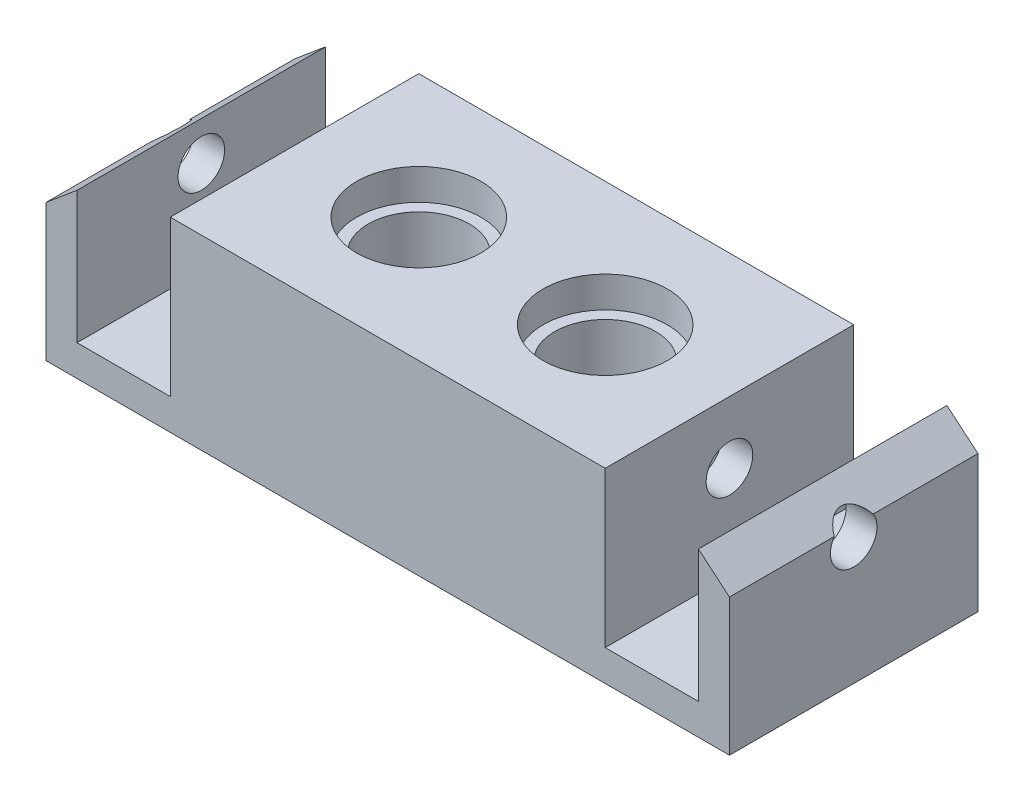
ISO-10303-21;
HEADER;
FILE_DESCRIPTION(('STEP AP214'),'2;1');
FILE_NAME('part.step','',(''),(''),'','','');
FILE_SCHEMA(('AUTOMOTIVE_DESIGN { 1 0 10303 214 1 1 1 1 }'));
ENDSEC;
DATA;
#1=APPLICATION_CONTEXT('core data for automotive mechanical design processes');
#2=APPLICATION_PROTOCOL_DEFINITION('international standard','automotive_design',2000,#1);
#3=PRODUCT_CONTEXT('',#1,'mechanical');
#4=PRODUCT('Part','Part','',(#3));
#5=PRODUCT_RELATED_PRODUCT_CATEGORY('part','',(#4));
#6=PRODUCT_DEFINITION_FORMATION('','',#4);
#7=PRODUCT_DEFINITION_CONTEXT('part definition',#1,'design');
#8=PRODUCT_DEFINITION('design','',#6,#7);
#9=PRODUCT_DEFINITION_SHAPE('','',#8);
#10=(LENGTH_UNIT() NAMED_UNIT(*) SI_UNIT(.MILLI.,.METRE.));
#11=(NAMED_UNIT(*) PLANE_ANGLE_UNIT() SI_UNIT($,.RADIAN.));
#12=(NAMED_UNIT(*) SI_UNIT($,.STERADIAN.) SOLID_ANGLE_UNIT());
#13=UNCERTAINTY_MEASURE_WITH_UNIT(LENGTH_MEASURE(1.E-05),#10,'distance_accuracy_value','');
#14=(GEOMETRIC_REPRESENTATION_CONTEXT(3) GLOBAL_UNCERTAINTY_ASSIGNED_CONTEXT((#13)) GLOBAL_UNIT_ASSIGNED_CONTEXT((#10,
#11,#12)) REPRESENTATION_CONTEXT('',''));
#15=CARTESIAN_POINT('',(0.,0.,0.));
#16=DIRECTION('',(0.,0.,1.));
#17=DIRECTION('',(1.,0.,0.));
#18=AXIS2_PLACEMENT_3D('',#15,#16,#17);
#19=CARTESIAN_POINT('',(14.,3.,-4.));
#20=DIRECTION('',(0.,-1.,0.));
#21=DIRECTION('',(0.,0.,-1.));
#22=AXIS2_PLACEMENT_3D('',#19,#20,#21);
#23=PLANE('',#22);
#24=CARTESIAN_POINT('',(14.,3.,-4.));
#25=DIRECTION('',(0.,-1.,0.));
#26=DIRECTION('',(0.,0.,-1.));
#27=AXIS2_PLACEMENT_3D('',#24,#25,#26);
#28=CIRCLE('',#27,2.5);
#29=CARTESIAN_POINT('',(14.,3.,-6.5));
#30=VERTEX_POINT('',#29);
#31=EDGE_CURVE('E11',#30,#30,#28,.T.);
#32=ORIENTED_EDGE('',*,*,#31,.T.);
#33=EDGE_LOOP('',(#32));
#34=FACE_BOUND('',#33,.T.);
#35=CARTESIAN_POINT('',(14.,3.,-4.));
#36=DIRECTION('',(0.,-1.,0.));
#37=DIRECTION('',(0.,0.,-1.));
#38=AXIS2_PLACEMENT_3D('',#35,#36,#37);
#39=CIRCLE('',#38,1.625);
#40=CARTESIAN_POINT('',(14.,3.,-5.625));
#41=VERTEX_POINT('',#40);
#42=EDGE_CURVE('E57',#41,#41,#39,.T.);
#43=ORIENTED_EDGE('',*,*,#42,.F.);
#44=EDGE_LOOP('',(#43));
#45=FACE_BOUND('',#44,.T.);
#46=ADVANCED_FACE('F46',(#34,#45),#23,.T.);
#47=CARTESIAN_POINT('',(14.,5.,-4.));
#48=DIRECTION('',(0.,-1.,0.));
#49=DIRECTION('',(0.,0.,-1.));
#50=AXIS2_PLACEMENT_3D('',#47,#48,#49);
#51=PLANE('',#50);
#52=CARTESIAN_POINT('',(14.,5.,-4.));
#53=DIRECTION('',(0.,-1.,0.));
#54=DIRECTION('',(0.,0.,-1.));
#55=AXIS2_PLACEMENT_3D('',#52,#53,#54);
#56=CIRCLE('',#55,2.5);
#57=CARTESIAN_POINT('',(14.,5.,-6.5));
#58=VERTEX_POINT('',#57);
#59=EDGE_CURVE('E50',#58,#58,#56,.T.);
#60=ORIENTED_EDGE('',*,*,#59,.F.);
#61=EDGE_LOOP('',(#60));
#62=FACE_BOUND('',#61,.T.);
#63=CARTESIAN_POINT('',(14.,5.,-4.));
#64=DIRECTION('',(0.,-1.,0.));
#65=DIRECTION('',(0.,0.,-1.));
#66=AXIS2_PLACEMENT_3D('',#63,#64,#65);
#67=CIRCLE('',#66,1.625);
#68=CARTESIAN_POINT('',(14.,5.,-5.625));
#69=VERTEX_POINT('',#68);
#70=EDGE_CURVE('E59',#69,#69,#67,.T.);
#71=ORIENTED_EDGE('',*,*,#70,.T.);
#72=EDGE_LOOP('',(#71));
#73=FACE_BOUND('',#72,.T.);
#74=ADVANCED_FACE('F69',(#62,#73),#51,.F.);
#75=CARTESIAN_POINT('',(14.,3.,-4.));
#76=DIRECTION('',(0.,1.,0.));
#77=DIRECTION('',(0.,0.,1.));
#78=AXIS2_PLACEMENT_3D('',#75,#76,#77);
#79=CYLINDRICAL_SURFACE('',#78,2.5);
#80=ORIENTED_EDGE('',*,*,#31,.F.);
#81=EDGE_LOOP('',(#80));
#82=FACE_BOUND('',#81,.T.);
#83=ORIENTED_EDGE('',*,*,#59,.T.);
#84=EDGE_LOOP('',(#83));
#85=FACE_BOUND('',#84,.T.);
#86=ADVANCED_FACE('F48',(#82,#85),#79,.T.);
#87=CARTESIAN_POINT('',(14.,3.,-4.));
#88=DIRECTION('',(0.,1.,0.));
#89=DIRECTION('',(0.,0.,1.));
#90=AXIS2_PLACEMENT_3D('',#87,#88,#89);
#91=CYLINDRICAL_SURFACE('',#90,1.625);
#92=ORIENTED_EDGE('',*,*,#42,.T.);
#93=EDGE_LOOP('',(#92));
#94=FACE_BOUND('',#93,.T.);
#95=ORIENTED_EDGE('',*,*,#70,.F.);
#96=EDGE_LOOP('',(#95));
#97=FACE_BOUND('',#96,.T.);
#98=ADVANCED_FACE('F65',(#94,#97),#91,.F.);
#99=CLOSED_SHELL('',(#46,#74,#86,#98));
#100=MANIFOLD_SOLID_BREP('B2',#99);
#101=CARTESIAN_POINT('',(8.,3.,-4.));
#102=DIRECTION('',(0.,-1.,0.));
#103=DIRECTION('',(0.,0.,-1.));
#104=AXIS2_PLACEMENT_3D('',#101,#102,#103);
#105=PLANE('',#104);
#106=CARTESIAN_POINT('',(8.,3.,-4.));
#107=DIRECTION('',(0.,-1.,0.));
#108=DIRECTION('',(0.,0.,-1.));
#109=AXIS2_PLACEMENT_3D('',#106,#107,#108);
#110=CIRCLE('',#109,2.5);
#111=CARTESIAN_POINT('',(8.,3.,-6.5));
#112=VERTEX_POINT('',#111);
#113=EDGE_CURVE('E45',#112,#112,#110,.T.);
#114=ORIENTED_EDGE('',*,*,#113,.T.);
#115=EDGE_LOOP('',(#114));
#116=FACE_BOUND('',#115,.T.);
#117=CARTESIAN_POINT('',(8.,3.,-4.));
#118=DIRECTION('',(0.,-1.,0.));
#119=DIRECTION('',(0.,0.,-1.));
#120=AXIS2_PLACEMENT_3D('',#117,#118,#119);
#121=CIRCLE('',#120,1.625);
#122=CARTESIAN_POINT('',(8.,3.,-5.625));
#123=VERTEX_POINT('',#122);
#124=EDGE_CURVE('E130',#123,#123,#121,.T.);
#125=ORIENTED_EDGE('',*,*,#124,.F.);
#126=EDGE_LOOP('',(#125));
#127=FACE_BOUND('',#126,.T.);
#128=ADVANCED_FACE('F119',(#116,#127),#105,.T.);
#129=CARTESIAN_POINT('',(8.,5.,-4.));
#130=DIRECTION('',(0.,-1.,0.));
#131=DIRECTION('',(0.,0.,-1.));
#132=AXIS2_PLACEMENT_3D('',#129,#130,#131);
#133=PLANE('',#132);
#134=CARTESIAN_POINT('',(8.,5.,-4.));
#135=DIRECTION('',(0.,-1.,0.));
#136=DIRECTION('',(0.,0.,-1.));
#137=AXIS2_PLACEMENT_3D('',#134,#135,#136);
#138=CIRCLE('',#137,2.5);
#139=CARTESIAN_POINT('',(8.,5.,-6.5));
#140=VERTEX_POINT('',#139);
#141=EDGE_CURVE('E123',#140,#140,#138,.T.);
#142=ORIENTED_EDGE('',*,*,#141,.F.);
#143=EDGE_LOOP('',(#142));
#144=FACE_BOUND('',#143,.T.);
#145=CARTESIAN_POINT('',(8.,5.,-4.));
#146=DIRECTION('',(0.,-1.,0.));
#147=DIRECTION('',(0.,0.,-1.));
#148=AXIS2_PLACEMENT_3D('',#145,#146,#147);
#149=CIRCLE('',#148,1.625);
#150=CARTESIAN_POINT('',(8.,5.,-5.625));
#151=VERTEX_POINT('',#150);
#152=EDGE_CURVE('E132',#151,#151,#149,.T.);
#153=ORIENTED_EDGE('',*,*,#152,.T.);
#154=EDGE_LOOP('',(#153));
#155=FACE_BOUND('',#154,.T.);
#156=ADVANCED_FACE('F142',(#144,#155),#133,.F.);
#157=CARTESIAN_POINT('',(8.,3.,-4.));
#158=DIRECTION('',(0.,1.,0.));
#159=DIRECTION('',(0.,0.,1.));
#160=AXIS2_PLACEMENT_3D('',#157,#158,#159);
#161=CYLINDRICAL_SURFACE('',#160,2.5);
#162=ORIENTED_EDGE('',*,*,#113,.F.);
#163=EDGE_LOOP('',(#162));
#164=FACE_BOUND('',#163,.T.);
#165=ORIENTED_EDGE('',*,*,#141,.T.);
#166=EDGE_LOOP('',(#165));
#167=FACE_BOUND('',#166,.T.);
#168=ADVANCED_FACE('F121',(#164,#167),#161,.T.);
#169=CARTESIAN_POINT('',(8.,3.,-4.));
#170=DIRECTION('',(0.,1.,0.));
#171=DIRECTION('',(0.,0.,1.));
#172=AXIS2_PLACEMENT_3D('',#169,#170,#171);
#173=CYLINDRICAL_SURFACE('',#172,1.625);
#174=ORIENTED_EDGE('',*,*,#124,.T.);
#175=EDGE_LOOP('',(#174));
#176=FACE_BOUND('',#175,.T.);
#177=ORIENTED_EDGE('',*,*,#152,.F.);
#178=EDGE_LOOP('',(#177));
#179=FACE_BOUND('',#178,.T.);
#180=ADVANCED_FACE('F138',(#176,#179),#173,.F.);
#181=CLOSED_SHELL('',(#128,#156,#168,#180));
#182=MANIFOLD_SOLID_BREP('B6',#181);
#183=CARTESIAN_POINT('',(0.,0.,-8.));
#184=DIRECTION('',(-1.,0.,0.));
#185=DIRECTION('',(0.,0.,1.));
#186=AXIS2_PLACEMENT_3D('',#183,#184,#185);
#187=PLANE('',#186);
#188=DIRECTION('',(0.,-1.,0.));
#189=VECTOR('',#188,1.);
#190=CARTESIAN_POINT('',(0.,0.,0.));
#191=LINE('',#190,#189);
#192=CARTESIAN_POINT('',(0.,4.41090036882271,0.));
#193=VERTEX_POINT('',#192);
#194=CARTESIAN_POINT('',(0.,0.,0.));
#195=VERTEX_POINT('',#194);
#196=EDGE_CURVE('E318',#193,#195,#191,.T.);
#197=ORIENTED_EDGE('',*,*,#196,.F.);
#198=DIRECTION('',(0.,0.,1.));
#199=VECTOR('',#198,1.);
#200=CARTESIAN_POINT('',(0.,4.41090036882271,-10.));
#201=LINE('',#200,#199);
#202=CARTESIAN_POINT('',(0.,4.41090036882271,-3.3725759911341));
#203=VERTEX_POINT('',#202);
#204=EDGE_CURVE('E304',#203,#193,#201,.T.);
#205=ORIENTED_EDGE('',*,*,#204,.F.);
#206=CARTESIAN_POINT('',(0.,4.,-4.));
#207=DIRECTION('',(1.,0.,0.));
#208=DIRECTION('',(0.,0.,-1.));
#209=AXIS2_PLACEMENT_3D('',#206,#207,#208);
#210=CIRCLE('',#209,0.750000000000001);
#211=CARTESIAN_POINT('',(0.,4.41090036882271,-4.6274240088659));
#212=VERTEX_POINT('',#211);
#213=EDGE_CURVE('E354',#203,#212,#210,.T.);
#214=ORIENTED_EDGE('',*,*,#213,.T.);
#215=CARTESIAN_POINT('',(0.,4.41090036882271,-8.));
#216=VERTEX_POINT('',#215);
#217=EDGE_CURVE('E197',#216,#212,#201,.T.);
#218=ORIENTED_EDGE('',*,*,#217,.F.);
#219=DIRECTION('',(0.,-1.,0.));
#220=VECTOR('',#219,1.);
#221=CARTESIAN_POINT('',(0.,0.,-8.));
#222=LINE('',#221,#220);
#223=CARTESIAN_POINT('',(0.,0.,-8.));
#224=VERTEX_POINT('',#223);
#225=EDGE_CURVE('E342',#216,#224,#222,.T.);
#226=ORIENTED_EDGE('',*,*,#225,.T.);
#227=DIRECTION('',(0.,0.,1.));
#228=VECTOR('',#227,1.);
#229=CARTESIAN_POINT('',(0.,0.,-8.));
#230=LINE('',#229,#228);
#231=EDGE_CURVE('E324',#224,#195,#230,.T.);
#232=ORIENTED_EDGE('',*,*,#231,.T.);
#233=EDGE_LOOP('',(#197,#205,#214,#218,#226,#232));
#234=FACE_BOUND('',#233,.T.);
#235=ADVANCED_FACE('F183',(#234),#187,.T.);
#236=CARTESIAN_POINT('',(0.,0.,-8.));
#237=DIRECTION('',(0.,0.,-1.));
#238=DIRECTION('',(-1.,0.,0.));
#239=AXIS2_PLACEMENT_3D('',#236,#237,#238);
#240=PLANE('',#239);
#241=ORIENTED_EDGE('',*,*,#225,.F.);
#242=DIRECTION('',(0.766044443118975,0.642787609686543,0.));
#243=VECTOR('',#242,1.);
#244=CARTESIAN_POINT('',(-2.17194444049051,2.58842258986957,-8.));
#245=LINE('',#244,#243);
#246=CARTESIAN_POINT('',(1.,5.25,-8.));
#247=VERTEX_POINT('',#246);
#248=EDGE_CURVE('E503',#216,#247,#245,.T.);
#249=ORIENTED_EDGE('',*,*,#248,.T.);
#250=DIRECTION('',(0.,-1.,0.));
#251=VECTOR('',#250,1.);
#252=CARTESIAN_POINT('',(1.,6.,-8.));
#253=LINE('',#252,#251);
#254=CARTESIAN_POINT('',(1.,1.,-8.));
#255=VERTEX_POINT('',#254);
#256=EDGE_CURVE('E378',#247,#255,#253,.T.);
#257=ORIENTED_EDGE('',*,*,#256,.T.);
#258=DIRECTION('',(1.,0.,0.));
#259=VECTOR('',#258,1.);
#260=CARTESIAN_POINT('',(1.,1.,-8.));
#261=LINE('',#260,#259);
#262=CARTESIAN_POINT('',(4.,1.,-8.));
#263=VERTEX_POINT('',#262);
#264=EDGE_CURVE('E380',#255,#263,#261,.T.);
#265=ORIENTED_EDGE('',*,*,#264,.T.);
#266=DIRECTION('',(0.,1.,0.));
#267=VECTOR('',#266,1.);
#268=CARTESIAN_POINT('',(4.,6.,-8.));
#269=LINE('',#268,#267);
#270=CARTESIAN_POINT('',(4.,6.,-8.));
#271=VERTEX_POINT('',#270);
#272=EDGE_CURVE('E384',#263,#271,#269,.T.);
#273=ORIENTED_EDGE('',*,*,#272,.T.);
#274=DIRECTION('',(-1.,0.,0.));
#275=VECTOR('',#274,1.);
#276=CARTESIAN_POINT('',(0.,6.,-8.));
#277=LINE('',#276,#275);
#278=CARTESIAN_POINT('',(18.,6.,-8.));
#279=VERTEX_POINT('',#278);
#280=EDGE_CURVE('E334',#279,#271,#277,.T.);
#281=ORIENTED_EDGE('',*,*,#280,.F.);
#282=DIRECTION('',(0.,-1.,0.));
#283=VECTOR('',#282,1.);
#284=CARTESIAN_POINT('',(18.,6.,-8.));
#285=LINE('',#284,#283);
#286=CARTESIAN_POINT('',(18.,1.,-8.));
#287=VERTEX_POINT('',#286);
#288=EDGE_CURVE('E402',#279,#287,#285,.T.);
#289=ORIENTED_EDGE('',*,*,#288,.T.);
#290=DIRECTION('',(1.,0.,0.));
#291=VECTOR('',#290,1.);
#292=CARTESIAN_POINT('',(21.,1.,-8.));
#293=LINE('',#292,#291);
#294=CARTESIAN_POINT('',(21.,1.,-8.));
#295=VERTEX_POINT('',#294);
#296=EDGE_CURVE('E405',#287,#295,#293,.T.);
#297=ORIENTED_EDGE('',*,*,#296,.T.);
#298=DIRECTION('',(0.,1.,0.));
#299=VECTOR('',#298,1.);
#300=CARTESIAN_POINT('',(21.,6.,-8.));
#301=LINE('',#300,#299);
#302=CARTESIAN_POINT('',(21.,5.25,-8.));
#303=VERTEX_POINT('',#302);
#304=EDGE_CURVE('E409',#295,#303,#301,.T.);
#305=ORIENTED_EDGE('',*,*,#304,.T.);
#306=DIRECTION('',(-0.766044443118975,0.642787609686543,0.));
#307=VECTOR('',#306,1.);
#308=CARTESIAN_POINT('',(11.2618144861544,13.4213078730039,-8.));
#309=LINE('',#308,#307);
#310=CARTESIAN_POINT('',(22.,4.41090036882271,-8.));
#311=VERTEX_POINT('',#310);
#312=EDGE_CURVE('E494',#311,#303,#309,.T.);
#313=ORIENTED_EDGE('',*,*,#312,.F.);
#314=DIRECTION('',(0.,1.,0.));
#315=VECTOR('',#314,1.);
#316=CARTESIAN_POINT('',(22.,0.,-8.));
#317=LINE('',#316,#315);
#318=CARTESIAN_POINT('',(22.,0.,-8.));
#319=VERTEX_POINT('',#318);
#320=EDGE_CURVE('E467',#319,#311,#317,.T.);
#321=ORIENTED_EDGE('',*,*,#320,.F.);
#322=DIRECTION('',(1.,0.,0.));
#323=VECTOR('',#322,1.);
#324=CARTESIAN_POINT('',(0.,0.,-8.));
#325=LINE('',#324,#323);
#326=EDGE_CURVE('E465',#224,#319,#325,.T.);
#327=ORIENTED_EDGE('',*,*,#326,.F.);
#328=EDGE_LOOP('',(#241,#249,#257,#265,#273,#281,#289,#297,#305,#313,#321,#327));
#329=FACE_BOUND('',#328,.T.);
#330=ADVANCED_FACE('F478',(#329),#240,.T.);
#331=CARTESIAN_POINT('',(0.,0.,0.));
#332=DIRECTION('',(0.,0.,-1.));
#333=DIRECTION('',(-1.,0.,0.));
#334=AXIS2_PLACEMENT_3D('',#331,#332,#333);
#335=PLANE('',#334);
#336=DIRECTION('',(-0.766044443118975,-0.642787609686543,0.));
#337=VECTOR('',#336,1.);
#338=CARTESIAN_POINT('',(0.,4.41090036882271,0.));
#339=LINE('',#338,#337);
#340=CARTESIAN_POINT('',(1.,5.25,0.));
#341=VERTEX_POINT('',#340);
#342=EDGE_CURVE('E307',#341,#193,#339,.T.);
#343=ORIENTED_EDGE('',*,*,#342,.T.);
#344=ORIENTED_EDGE('',*,*,#196,.T.);
#345=DIRECTION('',(1.,0.,0.));
#346=VECTOR('',#345,1.);
#347=CARTESIAN_POINT('',(0.,0.,0.));
#348=LINE('',#347,#346);
#349=CARTESIAN_POINT('',(22.,0.,0.));
#350=VERTEX_POINT('',#349);
#351=EDGE_CURVE('E326',#195,#350,#348,.T.);
#352=ORIENTED_EDGE('',*,*,#351,.T.);
#353=DIRECTION('',(0.,1.,0.));
#354=VECTOR('',#353,1.);
#355=CARTESIAN_POINT('',(22.,0.,0.));
#356=LINE('',#355,#354);
#357=CARTESIAN_POINT('',(22.,4.41090036882271,0.));
#358=VERTEX_POINT('',#357);
#359=EDGE_CURVE('E329',#350,#358,#356,.T.);
#360=ORIENTED_EDGE('',*,*,#359,.T.);
#361=DIRECTION('',(0.766044443118975,-0.642787609686543,0.));
#362=VECTOR('',#361,1.);
#363=CARTESIAN_POINT('',(22.,4.41090036882271,0.));
#364=LINE('',#363,#362);
#365=CARTESIAN_POINT('',(21.,5.25,0.));
#366=VERTEX_POINT('',#365);
#367=EDGE_CURVE('E500',#366,#358,#364,.T.);
#368=ORIENTED_EDGE('',*,*,#367,.F.);
#369=DIRECTION('',(0.,1.,0.));
#370=VECTOR('',#369,1.);
#371=CARTESIAN_POINT('',(21.,6.,0.));
#372=LINE('',#371,#370);
#373=CARTESIAN_POINT('',(21.,1.,0.));
#374=VERTEX_POINT('',#373);
#375=EDGE_CURVE('E406',#374,#366,#372,.T.);
#376=ORIENTED_EDGE('',*,*,#375,.F.);
#377=DIRECTION('',(1.,0.,0.));
#378=VECTOR('',#377,1.);
#379=CARTESIAN_POINT('',(21.,1.,0.));
#380=LINE('',#379,#378);
#381=CARTESIAN_POINT('',(18.,1.,0.));
#382=VERTEX_POINT('',#381);
#383=EDGE_CURVE('E415',#382,#374,#380,.T.);
#384=ORIENTED_EDGE('',*,*,#383,.F.);
#385=DIRECTION('',(0.,-1.,0.));
#386=VECTOR('',#385,1.);
#387=CARTESIAN_POINT('',(18.,6.,0.));
#388=LINE('',#387,#386);
#389=CARTESIAN_POINT('',(18.,6.,0.));
#390=VERTEX_POINT('',#389);
#391=EDGE_CURVE('E377',#390,#382,#388,.T.);
#392=ORIENTED_EDGE('',*,*,#391,.F.);
#393=DIRECTION('',(-1.,0.,0.));
#394=VECTOR('',#393,1.);
#395=CARTESIAN_POINT('',(0.,6.,0.));
#396=LINE('',#395,#394);
#397=CARTESIAN_POINT('',(4.,6.,0.));
#398=VERTEX_POINT('',#397);
#399=EDGE_CURVE('E339',#390,#398,#396,.T.);
#400=ORIENTED_EDGE('',*,*,#399,.T.);
#401=DIRECTION('',(0.,1.,0.));
#402=VECTOR('',#401,1.);
#403=CARTESIAN_POINT('',(4.,6.,0.));
#404=LINE('',#403,#402);
#405=CARTESIAN_POINT('',(4.,1.,0.));
#406=VERTEX_POINT('',#405);
#407=EDGE_CURVE('E381',#406,#398,#404,.T.);
#408=ORIENTED_EDGE('',*,*,#407,.F.);
#409=DIRECTION('',(1.,0.,0.));
#410=VECTOR('',#409,1.);
#411=CARTESIAN_POINT('',(1.,1.,0.));
#412=LINE('',#411,#410);
#413=CARTESIAN_POINT('',(1.,1.,0.));
#414=VERTEX_POINT('',#413);
#415=EDGE_CURVE('E389',#414,#406,#412,.T.);
#416=ORIENTED_EDGE('',*,*,#415,.F.);
#417=DIRECTION('',(0.,-1.,0.));
#418=VECTOR('',#417,1.);
#419=CARTESIAN_POINT('',(1.,6.,0.));
#420=LINE('',#419,#418);
#421=EDGE_CURVE('E321',#341,#414,#420,.T.);
#422=ORIENTED_EDGE('',*,*,#421,.F.);
#423=EDGE_LOOP('',(#343,#344,#352,#360,#368,#376,#384,#392,#400,#408,#416,#422));
#424=FACE_BOUND('',#423,.T.);
#425=ADVANCED_FACE('F316',(#424),#335,.F.);
#426=CARTESIAN_POINT('',(1.,6.,-8.));
#427=DIRECTION('',(-1.,0.,0.));
#428=DIRECTION('',(0.,-1.,0.));
#429=AXIS2_PLACEMENT_3D('',#426,#427,#428);
#430=PLANE('',#429);
#431=CARTESIAN_POINT('',(1.,4.,-4.));
#432=DIRECTION('',(-1.,0.,0.));
#433=DIRECTION('',(0.,-1.,0.));
#434=AXIS2_PLACEMENT_3D('',#431,#432,#433);
#435=CIRCLE('',#434,0.750000000000001);
#436=CARTESIAN_POINT('',(1.,3.25,-4.));
#437=VERTEX_POINT('',#436);
#438=EDGE_CURVE('E353',#437,#437,#435,.F.);
#439=ORIENTED_EDGE('',*,*,#438,.F.);
#440=EDGE_LOOP('',(#439));
#441=FACE_BOUND('',#440,.T.);
#442=DIRECTION('',(0.,0.,1.));
#443=VECTOR('',#442,1.);
#444=CARTESIAN_POINT('',(1.,5.25,-10.));
#445=LINE('',#444,#443);
#446=EDGE_CURVE('E518',#247,#341,#445,.T.);
#447=ORIENTED_EDGE('',*,*,#446,.T.);
#448=ORIENTED_EDGE('',*,*,#421,.T.);
#449=DIRECTION('',(0.,0.,1.));
#450=VECTOR('',#449,1.);
#451=CARTESIAN_POINT('',(1.,1.,-8.));
#452=LINE('',#451,#450);
#453=EDGE_CURVE('E387',#255,#414,#452,.T.);
#454=ORIENTED_EDGE('',*,*,#453,.F.);
#455=ORIENTED_EDGE('',*,*,#256,.F.);
#456=EDGE_LOOP('',(#447,#448,#454,#455));
#457=FACE_BOUND('',#456,.T.);
#458=ADVANCED_FACE('F513',(#441,#457),#430,.F.);
#459=CARTESIAN_POINT('',(5.5,4.,-4.));
#460=DIRECTION('',(-1.,0.,0.));
#461=DIRECTION('',(0.,0.,1.));
#462=AXIS2_PLACEMENT_3D('',#459,#460,#461);
#463=CYLINDRICAL_SURFACE('',#462,0.750000000000001);
#464=ORIENTED_EDGE('',*,*,#438,.T.);
#465=EDGE_LOOP('',(#464));
#466=FACE_BOUND('',#465,.T.);
#467=ORIENTED_EDGE('',*,*,#213,.F.);
#468=CARTESIAN_POINT('',(-0.489691990742751,4.,-4.));
#469=DIRECTION('',(-0.642787609686543,0.766044443118975,0.));
#470=DIRECTION('',(-0.766044443118975,-0.642787609686543,0.));
#471=AXIS2_PLACEMENT_3D('',#468,#469,#470);
#472=ELLIPSE('',#471,1.1667928701453,0.750000000000001);
#473=EDGE_CURVE('E117',#203,#212,#472,.T.);
#474=ORIENTED_EDGE('',*,*,#473,.T.);
#475=EDGE_LOOP('',(#467,#474));
#476=FACE_BOUND('',#475,.T.);
#477=ADVANCED_FACE('F510',(#466,#476),#463,.F.);
#478=CARTESIAN_POINT('',(0.,6.,-8.));
#479=DIRECTION('',(0.,1.,0.));
#480=DIRECTION('',(0.,0.,1.));
#481=AXIS2_PLACEMENT_3D('',#478,#479,#480);
#482=PLANE('',#481);
#483=DIRECTION('',(0.,0.,1.));
#484=VECTOR('',#483,1.);
#485=CARTESIAN_POINT('',(4.,6.,-8.));
#486=LINE('',#485,#484);
#487=EDGE_CURVE('E394',#271,#398,#486,.T.);
#488=ORIENTED_EDGE('',*,*,#487,.T.);
#489=ORIENTED_EDGE('',*,*,#399,.F.);
#490=DIRECTION('',(0.,0.,1.));
#491=VECTOR('',#490,1.);
#492=CARTESIAN_POINT('',(18.,6.,-8.));
#493=LINE('',#492,#491);
#494=EDGE_CURVE('E412',#279,#390,#493,.T.);
#495=ORIENTED_EDGE('',*,*,#494,.F.);
#496=ORIENTED_EDGE('',*,*,#280,.T.);
#497=EDGE_LOOP('',(#488,#489,#495,#496));
#498=FACE_BOUND('',#497,.T.);
#499=CARTESIAN_POINT('',(8.,6.,-4.));
#500=DIRECTION('',(0.,1.,0.));
#501=DIRECTION('',(0.,0.,1.));
#502=AXIS2_PLACEMENT_3D('',#499,#500,#501);
#503=CIRCLE('',#502,2.);
#504=CARTESIAN_POINT('',(8.,6.,-2.));
#505=VERTEX_POINT('',#504);
#506=EDGE_CURVE('E428',#505,#505,#503,.T.);
#507=ORIENTED_EDGE('',*,*,#506,.F.);
#508=EDGE_LOOP('',(#507));
#509=FACE_BOUND('',#508,.T.);
#510=CARTESIAN_POINT('',(14.,6.,-4.));
#511=DIRECTION('',(0.,1.,0.));
#512=DIRECTION('',(0.,0.,1.));
#513=AXIS2_PLACEMENT_3D('',#510,#511,#512);
#514=CIRCLE('',#513,2.);
#515=CARTESIAN_POINT('',(14.,6.,-2.));
#516=VERTEX_POINT('',#515);
#517=EDGE_CURVE('E397',#516,#516,#514,.T.);
#518=ORIENTED_EDGE('',*,*,#517,.F.);
#519=EDGE_LOOP('',(#518));
#520=FACE_BOUND('',#519,.T.);
#521=ADVANCED_FACE('F473',(#498,#509,#520),#482,.T.);
#522=CARTESIAN_POINT('',(22.,0.,-8.));
#523=DIRECTION('',(1.,0.,0.));
#524=DIRECTION('',(0.,0.,-1.));
#525=AXIS2_PLACEMENT_3D('',#522,#523,#524);
#526=PLANE('',#525);
#527=DIRECTION('',(0.,0.,1.));
#528=VECTOR('',#527,1.);
#529=CARTESIAN_POINT('',(22.,4.41090036882271,-10.));
#530=LINE('',#529,#528);
#531=CARTESIAN_POINT('',(22.,4.41090036882272,-3.3725759911341));
#532=VERTEX_POINT('',#531);
#533=EDGE_CURVE('E204',#532,#358,#530,.T.);
#534=ORIENTED_EDGE('',*,*,#533,.T.);
#535=ORIENTED_EDGE('',*,*,#359,.F.);
#536=DIRECTION('',(0.,0.,1.));
#537=VECTOR('',#536,1.);
#538=CARTESIAN_POINT('',(22.,0.,-8.));
#539=LINE('',#538,#537);
#540=EDGE_CURVE('E343',#319,#350,#539,.T.);
#541=ORIENTED_EDGE('',*,*,#540,.F.);
#542=ORIENTED_EDGE('',*,*,#320,.T.);
#543=CARTESIAN_POINT('',(22.,4.41090036882271,-4.6274240088659));
#544=VERTEX_POINT('',#543);
#545=EDGE_CURVE('E365',#311,#544,#530,.T.);
#546=ORIENTED_EDGE('',*,*,#545,.T.);
#547=CARTESIAN_POINT('',(22.,4.,-4.));
#548=DIRECTION('',(1.,0.,0.));
#549=DIRECTION('',(0.,0.,-1.));
#550=AXIS2_PLACEMENT_3D('',#547,#548,#549);
#551=CIRCLE('',#550,0.750000000000001);
#552=EDGE_CURVE('E350',#532,#544,#551,.T.);
#553=ORIENTED_EDGE('',*,*,#552,.F.);
#554=EDGE_LOOP('',(#534,#535,#541,#542,#546,#553));
#555=FACE_BOUND('',#554,.T.);
#556=ADVANCED_FACE('F362',(#555),#526,.T.);
#557=CARTESIAN_POINT('',(0.,0.,-8.));
#558=DIRECTION('',(0.,-1.,0.));
#559=DIRECTION('',(0.,0.,-1.));
#560=AXIS2_PLACEMENT_3D('',#557,#558,#559);
#561=PLANE('',#560);
#562=DIRECTION('',(0.,0.,1.));
#563=VECTOR('',#562,1.);
#564=CARTESIAN_POINT('',(17.,0.,-7.));
#565=LINE('',#564,#563);
#566=CARTESIAN_POINT('',(17.,0.,-7.));
#567=VERTEX_POINT('',#566);
#568=CARTESIAN_POINT('',(17.,0.,-1.));
#569=VERTEX_POINT('',#568);
#570=EDGE_CURVE('E427',#567,#569,#565,.T.);
#571=ORIENTED_EDGE('',*,*,#570,.F.);
#572=DIRECTION('',(1.,0.,0.));
#573=VECTOR('',#572,1.);
#574=CARTESIAN_POINT('',(5.,0.,-7.));
#575=LINE('',#574,#573);
#576=CARTESIAN_POINT('',(5.,0.,-7.));
#577=VERTEX_POINT('',#576);
#578=EDGE_CURVE('E440',#577,#567,#575,.T.);
#579=ORIENTED_EDGE('',*,*,#578,.F.);
#580=DIRECTION('',(0.,0.,-1.));
#581=VECTOR('',#580,1.);
#582=CARTESIAN_POINT('',(5.,0.,-7.));
#583=LINE('',#582,#581);
#584=CARTESIAN_POINT('',(5.,0.,-1.));
#585=VERTEX_POINT('',#584);
#586=EDGE_CURVE('E454',#585,#577,#583,.T.);
#587=ORIENTED_EDGE('',*,*,#586,.F.);
#588=DIRECTION('',(-1.,0.,0.));
#589=VECTOR('',#588,1.);
#590=CARTESIAN_POINT('',(5.,0.,-1.));
#591=LINE('',#590,#589);
#592=EDGE_CURVE('E451',#569,#585,#591,.T.);
#593=ORIENTED_EDGE('',*,*,#592,.F.);
#594=EDGE_LOOP('',(#571,#579,#587,#593));
#595=FACE_BOUND('',#594,.T.);
#596=ORIENTED_EDGE('',*,*,#351,.F.);
#597=ORIENTED_EDGE('',*,*,#231,.F.);
#598=ORIENTED_EDGE('',*,*,#326,.T.);
#599=ORIENTED_EDGE('',*,*,#540,.T.);
#600=EDGE_LOOP('',(#596,#597,#598,#599));
#601=FACE_BOUND('',#600,.T.);
#602=ADVANCED_FACE('F550',(#595,#601),#561,.T.);
#603=CARTESIAN_POINT('',(17.,5.,-7.));
#604=DIRECTION('',(1.,0.,0.));
#605=DIRECTION('',(0.,0.,-1.));
#606=AXIS2_PLACEMENT_3D('',#603,#604,#605);
#607=PLANE('',#606);
#608=CARTESIAN_POINT('',(17.,4.,-4.));
#609=DIRECTION('',(1.,0.,0.));
#610=DIRECTION('',(0.,0.,-1.));
#611=AXIS2_PLACEMENT_3D('',#608,#609,#610);
#612=CIRCLE('',#611,0.750000000000001);
#613=CARTESIAN_POINT('',(17.,4.,-4.75));
#614=VERTEX_POINT('',#613);
#615=EDGE_CURVE('E374',#614,#614,#612,.T.);
#616=ORIENTED_EDGE('',*,*,#615,.T.);
#617=EDGE_LOOP('',(#616));
#618=FACE_BOUND('',#617,.T.);
#619=ORIENTED_EDGE('',*,*,#570,.T.);
#620=DIRECTION('',(0.,-1.,0.));
#621=VECTOR('',#620,1.);
#622=CARTESIAN_POINT('',(17.,5.,-1.));
#623=LINE('',#622,#621);
#624=CARTESIAN_POINT('',(17.,5.,-1.));
#625=VERTEX_POINT('',#624);
#626=EDGE_CURVE('E449',#625,#569,#623,.T.);
#627=ORIENTED_EDGE('',*,*,#626,.F.);
#628=DIRECTION('',(0.,0.,1.));
#629=VECTOR('',#628,1.);
#630=CARTESIAN_POINT('',(17.,5.,-7.));
#631=LINE('',#630,#629);
#632=CARTESIAN_POINT('',(17.,5.,-7.));
#633=VERTEX_POINT('',#632);
#634=EDGE_CURVE('E436',#633,#625,#631,.T.);
#635=ORIENTED_EDGE('',*,*,#634,.F.);
#636=DIRECTION('',(0.,-1.,0.));
#637=VECTOR('',#636,1.);
#638=CARTESIAN_POINT('',(17.,5.,-7.));
#639=LINE('',#638,#637);
#640=EDGE_CURVE('E327',#633,#567,#639,.T.);
#641=ORIENTED_EDGE('',*,*,#640,.T.);
#642=EDGE_LOOP('',(#619,#627,#635,#641));
#643=FACE_BOUND('',#642,.T.);
#644=ADVANCED_FACE('F546',(#618,#643),#607,.F.);
#645=CARTESIAN_POINT('',(5.,5.,-7.));
#646=DIRECTION('',(0.,0.,-1.));
#647=DIRECTION('',(-1.,0.,0.));
#648=AXIS2_PLACEMENT_3D('',#645,#646,#647);
#649=PLANE('',#648);
#650=ORIENTED_EDGE('',*,*,#578,.T.);
#651=ORIENTED_EDGE('',*,*,#640,.F.);
#652=DIRECTION('',(1.,0.,0.));
#653=VECTOR('',#652,1.);
#654=CARTESIAN_POINT('',(5.,5.,-7.));
#655=LINE('',#654,#653);
#656=CARTESIAN_POINT('',(5.,5.,-7.));
#657=VERTEX_POINT('',#656);
#658=EDGE_CURVE('E446',#657,#633,#655,.T.);
#659=ORIENTED_EDGE('',*,*,#658,.F.);
#660=DIRECTION('',(0.,-1.,0.));
#661=VECTOR('',#660,1.);
#662=CARTESIAN_POINT('',(5.,5.,-7.));
#663=LINE('',#662,#661);
#664=EDGE_CURVE('E331',#657,#577,#663,.T.);
#665=ORIENTED_EDGE('',*,*,#664,.T.);
#666=EDGE_LOOP('',(#650,#651,#659,#665));
#667=FACE_BOUND('',#666,.T.);
#668=ADVANCED_FACE('F556',(#667),#649,.F.);
#669=CARTESIAN_POINT('',(5.,5.,-7.));
#670=DIRECTION('',(-1.,0.,0.));
#671=DIRECTION('',(0.,0.,1.));
#672=AXIS2_PLACEMENT_3D('',#669,#670,#671);
#673=PLANE('',#672);
#674=CARTESIAN_POINT('',(5.,4.,-4.));
#675=DIRECTION('',(-1.,0.,0.));
#676=DIRECTION('',(0.,0.,1.));
#677=AXIS2_PLACEMENT_3D('',#674,#675,#676);
#678=CIRCLE('',#677,0.750000000000001);
#679=CARTESIAN_POINT('',(5.,4.,-3.25));
#680=VERTEX_POINT('',#679);
#681=EDGE_CURVE('E366',#680,#680,#678,.F.);
#682=ORIENTED_EDGE('',*,*,#681,.F.);
#683=EDGE_LOOP('',(#682));
#684=FACE_BOUND('',#683,.T.);
#685=ORIENTED_EDGE('',*,*,#586,.T.);
#686=ORIENTED_EDGE('',*,*,#664,.F.);
#687=DIRECTION('',(0.,0.,-1.));
#688=VECTOR('',#687,1.);
#689=CARTESIAN_POINT('',(5.,5.,-7.));
#690=LINE('',#689,#688);
#691=CARTESIAN_POINT('',(5.,5.,-1.));
#692=VERTEX_POINT('',#691);
#693=EDGE_CURVE('E443',#692,#657,#690,.T.);
#694=ORIENTED_EDGE('',*,*,#693,.F.);
#695=DIRECTION('',(0.,-1.,0.));
#696=VECTOR('',#695,1.);
#697=CARTESIAN_POINT('',(5.,5.,-1.));
#698=LINE('',#697,#696);
#699=EDGE_CURVE('E460',#692,#585,#698,.T.);
#700=ORIENTED_EDGE('',*,*,#699,.T.);
#701=EDGE_LOOP('',(#685,#686,#694,#700));
#702=FACE_BOUND('',#701,.T.);
#703=ADVANCED_FACE('F654',(#684,#702),#673,.F.);
#704=CARTESIAN_POINT('',(5.,5.,-1.));
#705=DIRECTION('',(0.,0.,1.));
#706=DIRECTION('',(1.,0.,0.));
#707=AXIS2_PLACEMENT_3D('',#704,#705,#706);
#708=PLANE('',#707);
#709=ORIENTED_EDGE('',*,*,#592,.T.);
#710=ORIENTED_EDGE('',*,*,#699,.F.);
#711=DIRECTION('',(-1.,0.,0.));
#712=VECTOR('',#711,1.);
#713=CARTESIAN_POINT('',(5.,5.,-1.));
#714=LINE('',#713,#712);
#715=EDGE_CURVE('E439',#625,#692,#714,.T.);
#716=ORIENTED_EDGE('',*,*,#715,.F.);
#717=ORIENTED_EDGE('',*,*,#626,.T.);
#718=EDGE_LOOP('',(#709,#710,#716,#717));
#719=FACE_BOUND('',#718,.T.);
#720=ADVANCED_FACE('F659',(#719),#708,.F.);
#721=CARTESIAN_POINT('',(0.,5.,0.));
#722=DIRECTION('',(0.,1.,0.));
#723=DIRECTION('',(0.,0.,1.));
#724=AXIS2_PLACEMENT_3D('',#721,#722,#723);
#725=PLANE('',#724);
#726=CARTESIAN_POINT('',(8.,5.,-4.));
#727=DIRECTION('',(0.,1.,0.));
#728=DIRECTION('',(0.,0.,1.));
#729=AXIS2_PLACEMENT_3D('',#726,#727,#728);
#730=CIRCLE('',#729,2.);
#731=CARTESIAN_POINT('',(8.,5.,-2.));
#732=VERTEX_POINT('',#731);
#733=EDGE_CURVE('E424',#732,#732,#730,.T.);
#734=ORIENTED_EDGE('',*,*,#733,.T.);
#735=EDGE_LOOP('',(#734));
#736=FACE_BOUND('',#735,.T.);
#737=CARTESIAN_POINT('',(14.,5.,-4.));
#738=DIRECTION('',(0.,1.,0.));
#739=DIRECTION('',(0.,0.,1.));
#740=AXIS2_PLACEMENT_3D('',#737,#738,#739);
#741=CIRCLE('',#740,2.);
#742=CARTESIAN_POINT('',(14.,5.,-2.));
#743=VERTEX_POINT('',#742);
#744=EDGE_CURVE('E431',#743,#743,#741,.T.);
#745=ORIENTED_EDGE('',*,*,#744,.T.);
#746=EDGE_LOOP('',(#745));
#747=FACE_BOUND('',#746,.T.);
#748=ORIENTED_EDGE('',*,*,#634,.T.);
#749=ORIENTED_EDGE('',*,*,#715,.T.);
#750=ORIENTED_EDGE('',*,*,#693,.T.);
#751=ORIENTED_EDGE('',*,*,#658,.T.);
#752=EDGE_LOOP('',(#748,#749,#750,#751));
#753=FACE_BOUND('',#752,.T.);
#754=ADVANCED_FACE('F718',(#736,#747,#753),#725,.F.);
#755=CARTESIAN_POINT('',(14.,5.,-4.));
#756=DIRECTION('',(0.,1.,0.));
#757=DIRECTION('',(0.,0.,1.));
#758=AXIS2_PLACEMENT_3D('',#755,#756,#757);
#759=CYLINDRICAL_SURFACE('',#758,2.);
#760=ORIENTED_EDGE('',*,*,#744,.F.);
#761=EDGE_LOOP('',(#760));
#762=FACE_BOUND('',#761,.T.);
#763=ORIENTED_EDGE('',*,*,#517,.T.);
#764=EDGE_LOOP('',(#763));
#765=FACE_BOUND('',#764,.T.);
#766=ADVANCED_FACE('F708',(#762,#765),#759,.F.);
#767=CARTESIAN_POINT('',(8.,5.,-4.));
#768=DIRECTION('',(0.,1.,0.));
#769=DIRECTION('',(0.,0.,1.));
#770=AXIS2_PLACEMENT_3D('',#767,#768,#769);
#771=CYLINDRICAL_SURFACE('',#770,2.);
#772=ORIENTED_EDGE('',*,*,#733,.F.);
#773=EDGE_LOOP('',(#772));
#774=FACE_BOUND('',#773,.T.);
#775=ORIENTED_EDGE('',*,*,#506,.T.);
#776=EDGE_LOOP('',(#775));
#777=FACE_BOUND('',#776,.T.);
#778=ADVANCED_FACE('F617',(#774,#777),#771,.F.);
#779=CARTESIAN_POINT('',(21.,6.,-8.));
#780=DIRECTION('',(1.,0.,0.));
#781=DIRECTION('',(0.,0.,-1.));
#782=AXIS2_PLACEMENT_3D('',#779,#780,#781);
#783=PLANE('',#782);
#784=CARTESIAN_POINT('',(21.,4.,-4.));
#785=DIRECTION('',(1.,0.,0.));
#786=DIRECTION('',(0.,0.,-1.));
#787=AXIS2_PLACEMENT_3D('',#784,#785,#786);
#788=CIRCLE('',#787,0.750000000000001);
#789=CARTESIAN_POINT('',(21.,4.,-4.75));
#790=VERTEX_POINT('',#789);
#791=EDGE_CURVE('E349',#790,#790,#788,.T.);
#792=ORIENTED_EDGE('',*,*,#791,.T.);
#793=EDGE_LOOP('',(#792));
#794=FACE_BOUND('',#793,.T.);
#795=ORIENTED_EDGE('',*,*,#375,.T.);
#796=DIRECTION('',(0.,0.,1.));
#797=VECTOR('',#796,1.);
#798=CARTESIAN_POINT('',(21.,5.25,-10.));
#799=LINE('',#798,#797);
#800=EDGE_CURVE('E498',#303,#366,#799,.T.);
#801=ORIENTED_EDGE('',*,*,#800,.F.);
#802=ORIENTED_EDGE('',*,*,#304,.F.);
#803=DIRECTION('',(0.,0.,1.));
#804=VECTOR('',#803,1.);
#805=CARTESIAN_POINT('',(21.,1.,-8.));
#806=LINE('',#805,#804);
#807=EDGE_CURVE('E390',#295,#374,#806,.T.);
#808=ORIENTED_EDGE('',*,*,#807,.T.);
#809=EDGE_LOOP('',(#795,#801,#802,#808));
#810=FACE_BOUND('',#809,.T.);
#811=ADVANCED_FACE('F497',(#794,#810),#783,.F.);
#812=CARTESIAN_POINT('',(21.,1.,-8.));
#813=DIRECTION('',(0.,-1.,0.));
#814=DIRECTION('',(1.,0.,0.));
#815=AXIS2_PLACEMENT_3D('',#812,#813,#814);
#816=PLANE('',#815);
#817=ORIENTED_EDGE('',*,*,#383,.T.);
#818=ORIENTED_EDGE('',*,*,#807,.F.);
#819=ORIENTED_EDGE('',*,*,#296,.F.);
#820=DIRECTION('',(0.,0.,1.));
#821=VECTOR('',#820,1.);
#822=CARTESIAN_POINT('',(18.,1.,-8.));
#823=LINE('',#822,#821);
#824=EDGE_CURVE('E421',#287,#382,#823,.T.);
#825=ORIENTED_EDGE('',*,*,#824,.T.);
#826=EDGE_LOOP('',(#817,#818,#819,#825));
#827=FACE_BOUND('',#826,.T.);
#828=ADVANCED_FACE('F491',(#827),#816,.F.);
#829=CARTESIAN_POINT('',(18.,6.,-8.));
#830=DIRECTION('',(-1.,0.,0.));
#831=DIRECTION('',(0.,-1.,0.));
#832=AXIS2_PLACEMENT_3D('',#829,#830,#831);
#833=PLANE('',#832);
#834=CARTESIAN_POINT('',(18.,4.,-4.));
#835=DIRECTION('',(-1.,0.,0.));
#836=DIRECTION('',(0.,-1.,0.));
#837=AXIS2_PLACEMENT_3D('',#834,#835,#836);
#838=CIRCLE('',#837,0.750000000000001);
#839=CARTESIAN_POINT('',(18.,3.25,-4.));
#840=VERTEX_POINT('',#839);
#841=EDGE_CURVE('E346',#840,#840,#838,.T.);
#842=ORIENTED_EDGE('',*,*,#841,.T.);
#843=EDGE_LOOP('',(#842));
#844=FACE_BOUND('',#843,.T.);
#845=ORIENTED_EDGE('',*,*,#391,.T.);
#846=ORIENTED_EDGE('',*,*,#824,.F.);
#847=ORIENTED_EDGE('',*,*,#288,.F.);
#848=ORIENTED_EDGE('',*,*,#494,.T.);
#849=EDGE_LOOP('',(#845,#846,#847,#848));
#850=FACE_BOUND('',#849,.T.);
#851=ADVANCED_FACE('F488',(#844,#850),#833,.F.);
#852=CARTESIAN_POINT('',(4.,6.,-8.));
#853=DIRECTION('',(1.,0.,0.));
#854=DIRECTION('',(0.,1.,0.));
#855=AXIS2_PLACEMENT_3D('',#852,#853,#854);
#856=PLANE('',#855);
#857=CARTESIAN_POINT('',(4.,4.,-4.));
#858=DIRECTION('',(1.,0.,0.));
#859=DIRECTION('',(0.,1.,0.));
#860=AXIS2_PLACEMENT_3D('',#857,#858,#859);
#861=CIRCLE('',#860,0.750000000000001);
#862=CARTESIAN_POINT('',(4.,4.75,-4.));
#863=VERTEX_POINT('',#862);
#864=EDGE_CURVE('E351',#863,#863,#861,.F.);
#865=ORIENTED_EDGE('',*,*,#864,.F.);
#866=EDGE_LOOP('',(#865));
#867=FACE_BOUND('',#866,.T.);
#868=ORIENTED_EDGE('',*,*,#407,.T.);
#869=ORIENTED_EDGE('',*,*,#487,.F.);
#870=ORIENTED_EDGE('',*,*,#272,.F.);
#871=DIRECTION('',(0.,0.,1.));
#872=VECTOR('',#871,1.);
#873=CARTESIAN_POINT('',(4.,1.,-8.));
#874=LINE('',#873,#872);
#875=EDGE_CURVE('E398',#263,#406,#874,.T.);
#876=ORIENTED_EDGE('',*,*,#875,.T.);
#877=EDGE_LOOP('',(#868,#869,#870,#876));
#878=FACE_BOUND('',#877,.T.);
#879=ADVANCED_FACE('F482',(#867,#878),#856,.F.);
#880=CARTESIAN_POINT('',(1.,1.,-8.));
#881=DIRECTION('',(0.,-1.,0.));
#882=DIRECTION('',(0.,0.,-1.));
#883=AXIS2_PLACEMENT_3D('',#880,#881,#882);
#884=PLANE('',#883);
#885=ORIENTED_EDGE('',*,*,#415,.T.);
#886=ORIENTED_EDGE('',*,*,#875,.F.);
#887=ORIENTED_EDGE('',*,*,#264,.F.);
#888=ORIENTED_EDGE('',*,*,#453,.T.);
#889=EDGE_LOOP('',(#885,#886,#887,#888));
#890=FACE_BOUND('',#889,.T.);
#891=ADVANCED_FACE('F644',(#890),#884,.F.);
#892=CARTESIAN_POINT('',(16.5,4.,-4.));
#893=DIRECTION('',(1.,0.,0.));
#894=DIRECTION('',(0.,0.,-1.));
#895=AXIS2_PLACEMENT_3D('',#892,#893,#894);
#896=CYLINDRICAL_SURFACE('',#895,0.750000000000001);
#897=ORIENTED_EDGE('',*,*,#841,.F.);
#898=EDGE_LOOP('',(#897));
#899=FACE_BOUND('',#898,.T.);
#900=ORIENTED_EDGE('',*,*,#615,.F.);
#901=EDGE_LOOP('',(#900));
#902=FACE_BOUND('',#901,.T.);
#903=ADVANCED_FACE('F607',(#899,#902),#896,.F.);
#904=ORIENTED_EDGE('',*,*,#552,.T.);
#905=CARTESIAN_POINT('',(22.4896919907428,4.,-4.));
#906=DIRECTION('',(-0.642787609686543,-0.766044443118975,0.));
#907=DIRECTION('',(0.766044443118975,-0.642787609686543,0.));
#908=AXIS2_PLACEMENT_3D('',#905,#906,#907);
#909=ELLIPSE('',#908,1.1667928701453,0.750000000000001);
#910=EDGE_CURVE('E190',#544,#532,#909,.F.);
#911=ORIENTED_EDGE('',*,*,#910,.T.);
#912=EDGE_LOOP('',(#904,#911));
#913=FACE_BOUND('',#912,.T.);
#914=ORIENTED_EDGE('',*,*,#791,.F.);
#915=EDGE_LOOP('',(#914));
#916=FACE_BOUND('',#915,.T.);
#917=ADVANCED_FACE('F358',(#913,#916),#896,.F.);
#918=ORIENTED_EDGE('',*,*,#864,.T.);
#919=EDGE_LOOP('',(#918));
#920=FACE_BOUND('',#919,.T.);
#921=ORIENTED_EDGE('',*,*,#681,.T.);
#922=EDGE_LOOP('',(#921));
#923=FACE_BOUND('',#922,.T.);
#924=ADVANCED_FACE('F526',(#920,#923),#463,.F.);
#925=CARTESIAN_POINT('',(22.,4.41090036882271,-10.));
#926=DIRECTION('',(-0.642787609686543,-0.766044443118975,0.));
#927=DIRECTION('',(0.766044443118975,-0.642787609686543,0.));
#928=AXIS2_PLACEMENT_3D('',#925,#926,#927);
#929=PLANE('',#928);
#930=ORIENTED_EDGE('',*,*,#312,.T.);
#931=ORIENTED_EDGE('',*,*,#800,.T.);
#932=ORIENTED_EDGE('',*,*,#367,.T.);
#933=ORIENTED_EDGE('',*,*,#533,.F.);
#934=ORIENTED_EDGE('',*,*,#910,.F.);
#935=ORIENTED_EDGE('',*,*,#545,.F.);
#936=EDGE_LOOP('',(#930,#931,#932,#933,#934,#935));
#937=FACE_BOUND('',#936,.T.);
#938=ADVANCED_FACE('F534',(#937),#929,.F.);
#939=CARTESIAN_POINT('',(0.,4.41090036882271,-10.));
#940=DIRECTION('',(-0.642787609686543,0.766044443118975,0.));
#941=DIRECTION('',(-0.766044443118975,-0.642787609686543,0.));
#942=AXIS2_PLACEMENT_3D('',#939,#940,#941);
#943=PLANE('',#942);
#944=ORIENTED_EDGE('',*,*,#217,.T.);
#945=ORIENTED_EDGE('',*,*,#473,.F.);
#946=ORIENTED_EDGE('',*,*,#204,.T.);
#947=ORIENTED_EDGE('',*,*,#342,.F.);
#948=ORIENTED_EDGE('',*,*,#446,.F.);
#949=ORIENTED_EDGE('',*,*,#248,.F.);
#950=EDGE_LOOP('',(#944,#945,#946,#947,#948,#949));
#951=FACE_BOUND('',#950,.T.);
#952=ADVANCED_FACE('F306',(#951),#943,.T.);
#953=CLOSED_SHELL('',(#235,#330,#425,#458,#477,#521,#556,#602,#644,#668,#703,#720,#754,#766,
#778,#811,#828,#851,#879,#891,#903,#917,#924,#938,#952));
#954=MANIFOLD_SOLID_BREP('B40',#953);
#955=ADVANCED_BREP_SHAPE_REPRESENTATION('',(#18,#100,#182,#954),#14);
#956=SHAPE_DEFINITION_REPRESENTATION(#9,#955);
ENDSEC;
END-ISO-10303-21;
